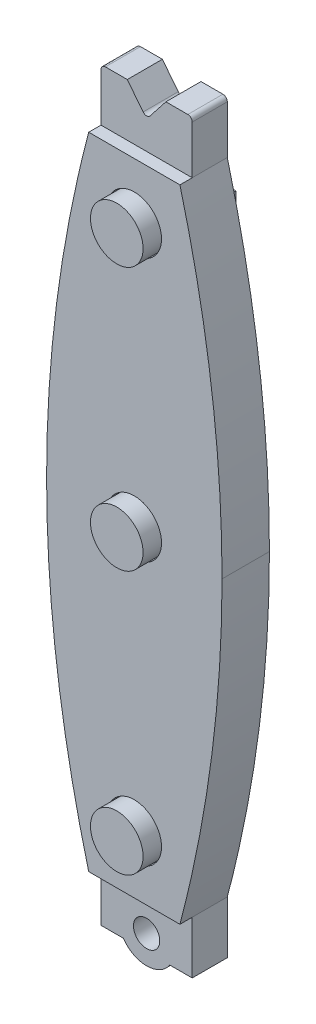
ISO-10303-21;
HEADER;
FILE_DESCRIPTION(('STEP AP214'),'2;1');
FILE_NAME('part.step','',(''),(''),'','','');
FILE_SCHEMA(('AUTOMOTIVE_DESIGN { 1 0 10303 214 1 1 1 1 }'));
ENDSEC;
DATA;
#1=APPLICATION_CONTEXT('core data for automotive mechanical design processes');
#2=APPLICATION_PROTOCOL_DEFINITION('international standard','automotive_design',2000,#1);
#3=PRODUCT_CONTEXT('',#1,'mechanical');
#4=PRODUCT('Part','Part','',(#3));
#5=PRODUCT_RELATED_PRODUCT_CATEGORY('part','',(#4));
#6=PRODUCT_DEFINITION_FORMATION('','',#4);
#7=PRODUCT_DEFINITION_CONTEXT('part definition',#1,'design');
#8=PRODUCT_DEFINITION('design','',#6,#7);
#9=PRODUCT_DEFINITION_SHAPE('','',#8);
#10=(LENGTH_UNIT() NAMED_UNIT(*) SI_UNIT(.MILLI.,.METRE.));
#11=(NAMED_UNIT(*) PLANE_ANGLE_UNIT() SI_UNIT($,.RADIAN.));
#12=(NAMED_UNIT(*) SI_UNIT($,.STERADIAN.) SOLID_ANGLE_UNIT());
#13=UNCERTAINTY_MEASURE_WITH_UNIT(LENGTH_MEASURE(1.E-05),#10,'distance_accuracy_value','');
#14=(GEOMETRIC_REPRESENTATION_CONTEXT(3) GLOBAL_UNCERTAINTY_ASSIGNED_CONTEXT((#13)) GLOBAL_UNIT_ASSIGNED_CONTEXT((#10,
#11,#12)) REPRESENTATION_CONTEXT('',''));
#15=CARTESIAN_POINT('',(0.,0.,0.));
#16=DIRECTION('',(0.,0.,1.));
#17=DIRECTION('',(1.,0.,0.));
#18=AXIS2_PLACEMENT_3D('',#15,#16,#17);
#19=CARTESIAN_POINT('',(0.,0.,0.));
#20=DIRECTION('',(0.,0.,1.));
#21=DIRECTION('',(1.,0.,0.));
#22=AXIS2_PLACEMENT_3D('',#19,#20,#21);
#23=PLANE('',#22);
#24=DIRECTION('',(0.,1.,0.));
#25=VECTOR('',#24,1.);
#26=CARTESIAN_POINT('',(-26.9659834710744,-62.6986404958678,0.));
#27=LINE('',#26,#25);
#28=CARTESIAN_POINT('',(-26.9659834710744,-58.3806404958678,0.));
#29=VERTEX_POINT('',#28);
#30=CARTESIAN_POINT('',(-26.9659834710744,-50.7606404958678,0.));
#31=VERTEX_POINT('',#30);
#32=EDGE_CURVE('E579',#29,#31,#27,.T.);
#33=ORIENTED_EDGE('',*,*,#32,.T.);
#34=CARTESIAN_POINT('',(-26.9659834710744,-50.7606404958678,0.));
#35=CARTESIAN_POINT('',(-33.0619834710744,-27.5831404958678,0.));
#36=CARTESIAN_POINT('',(-33.0619834710744,-4.40564049586777,0.));
#37=B_SPLINE_CURVE_WITH_KNOTS('',2,(#34,#35,#36),.UNSPECIFIED.,.F.,.F.,(3,3),(0.5,1.),.UNSPECIFIED.);
#38=CARTESIAN_POINT('',(-33.0619834710744,-4.40564049586777,0.));
#39=VERTEX_POINT('',#38);
#40=EDGE_CURVE('E219',#31,#39,#37,.T.);
#41=ORIENTED_EDGE('',*,*,#40,.T.);
#42=CARTESIAN_POINT('',(-33.0619834710744,-4.40564049586779,0.));
#43=CARTESIAN_POINT('',(-33.0619834710744,18.7718595041322,0.));
#44=CARTESIAN_POINT('',(-26.9659834710744,41.9493595041322,0.));
#45=B_SPLINE_CURVE_WITH_KNOTS('',2,(#42,#43,#44),.UNSPECIFIED.,.F.,.F.,(3,3),(0.,0.5),.UNSPECIFIED.);
#46=CARTESIAN_POINT('',(-26.9659834710744,41.9493595041322,0.));
#47=VERTEX_POINT('',#46);
#48=EDGE_CURVE('E291',#39,#47,#45,.T.);
#49=ORIENTED_EDGE('',*,*,#48,.T.);
#50=DIRECTION('',(0.,-1.,0.));
#51=VECTOR('',#50,1.);
#52=CARTESIAN_POINT('',(-26.9659834710744,49.5693595041322,0.));
#53=LINE('',#52,#51);
#54=CARTESIAN_POINT('',(-26.9659834710744,48.9343595041322,0.));
#55=VERTEX_POINT('',#54);
#56=EDGE_CURVE('E482',#55,#47,#53,.T.);
#57=ORIENTED_EDGE('',*,*,#56,.F.);
#58=CARTESIAN_POINT('',(-26.3309834710744,48.9343595041322,0.));
#59=DIRECTION('',(0.,0.,1.));
#60=DIRECTION('',(1.,0.,0.));
#61=AXIS2_PLACEMENT_3D('',#58,#59,#60);
#62=CIRCLE('',#61,0.635);
#63=CARTESIAN_POINT('',(-26.3309834710744,49.5693595041322,0.));
#64=VERTEX_POINT('',#63);
#65=EDGE_CURVE('E594',#55,#64,#62,.F.);
#66=ORIENTED_EDGE('',*,*,#65,.T.);
#67=DIRECTION('',(-1.,0.,0.));
#68=VECTOR('',#67,1.);
#69=CARTESIAN_POINT('',(-13.7579834710744,49.5693595041322,0.));
#70=LINE('',#69,#68);
#71=CARTESIAN_POINT('',(-23.1559834710744,49.5693595041322,0.));
#72=VERTEX_POINT('',#71);
#73=EDGE_CURVE('E478',#72,#64,#70,.T.);
#74=ORIENTED_EDGE('',*,*,#73,.F.);
#75=DIRECTION('',(0.617821551931903,-0.786318338822423,0.));
#76=VECTOR('',#75,1.);
#77=CARTESIAN_POINT('',(-23.1559834710744,49.5693595041322,0.));
#78=LINE('',#77,#76);
#79=CARTESIAN_POINT('',(-20.8612956162266,46.6488476888714,0.));
#80=VERTEX_POINT('',#79);
#81=EDGE_CURVE('E457',#72,#80,#78,.T.);
#82=ORIENTED_EDGE('',*,*,#81,.T.);
#83=CARTESIAN_POINT('',(-20.3619834710744,47.0411643743482,0.));
#84=DIRECTION('',(0.,0.,1.));
#85=DIRECTION('',(1.,0.,0.));
#86=AXIS2_PLACEMENT_3D('',#83,#84,#85);
#87=CIRCLE('',#86,0.635);
#88=CARTESIAN_POINT('',(-19.8626713259222,46.6488476888714,0.));
#89=VERTEX_POINT('',#88);
#90=EDGE_CURVE('E11',#80,#89,#87,.T.);
#91=ORIENTED_EDGE('',*,*,#90,.T.);
#92=DIRECTION('',(0.617821551931903,0.786318338822423,0.));
#93=VECTOR('',#92,1.);
#94=CARTESIAN_POINT('',(-20.3619834710744,46.0133595041322,0.));
#95=LINE('',#94,#93);
#96=CARTESIAN_POINT('',(-17.5679834710744,49.5693595041322,0.));
#97=VERTEX_POINT('',#96);
#98=EDGE_CURVE('E454',#89,#97,#95,.T.);
#99=ORIENTED_EDGE('',*,*,#98,.T.);
#100=CARTESIAN_POINT('',(-14.3929834710744,49.5693595041322,0.));
#101=VERTEX_POINT('',#100);
#102=EDGE_CURVE('E480',#101,#97,#70,.T.);
#103=ORIENTED_EDGE('',*,*,#102,.F.);
#104=CARTESIAN_POINT('',(-14.3929834710744,48.9343595041322,0.));
#105=DIRECTION('',(0.,0.,1.));
#106=DIRECTION('',(1.,0.,0.));
#107=AXIS2_PLACEMENT_3D('',#104,#105,#106);
#108=CIRCLE('',#107,0.635);
#109=CARTESIAN_POINT('',(-13.7579834710744,48.9343595041322,0.));
#110=VERTEX_POINT('',#109);
#111=EDGE_CURVE('E592',#101,#110,#108,.F.);
#112=ORIENTED_EDGE('',*,*,#111,.T.);
#113=DIRECTION('',(0.,-1.,0.));
#114=VECTOR('',#113,1.);
#115=CARTESIAN_POINT('',(-13.7579834710744,49.5693595041322,0.));
#116=LINE('',#115,#114);
#117=CARTESIAN_POINT('',(-13.7579834710744,41.9493595041322,0.));
#118=VERTEX_POINT('',#117);
#119=EDGE_CURVE('E493',#110,#118,#116,.T.);
#120=ORIENTED_EDGE('',*,*,#119,.T.);
#121=CARTESIAN_POINT('',(-13.7579834710744,41.9493595041322,0.));
#122=CARTESIAN_POINT('',(-7.6619834710744,18.7718595041322,0.));
#123=CARTESIAN_POINT('',(-7.6619834710744,-4.40564049586779,0.));
#124=B_SPLINE_CURVE_WITH_KNOTS('',2,(#121,#122,#123),.UNSPECIFIED.,.F.,.F.,(3,3),(0.,0.5),.UNSPECIFIED.);
#125=CARTESIAN_POINT('',(-7.6619834710744,-4.4056404958678,0.));
#126=VERTEX_POINT('',#125);
#127=EDGE_CURVE('E472',#118,#126,#124,.T.);
#128=ORIENTED_EDGE('',*,*,#127,.T.);
#129=CARTESIAN_POINT('',(-7.6619834710744,-4.4056404958678,0.));
#130=CARTESIAN_POINT('',(-7.66198347107439,-27.5831404958678,0.));
#131=CARTESIAN_POINT('',(-13.7579834710744,-50.7606404958678,0.));
#132=B_SPLINE_CURVE_WITH_KNOTS('',2,(#129,#130,#131),.UNSPECIFIED.,.F.,.F.,(3,3),(0.,
0.500000000000001),.UNSPECIFIED.);
#133=CARTESIAN_POINT('',(-13.7579834710744,-50.7606404958678,0.));
#134=VERTEX_POINT('',#133);
#135=EDGE_CURVE('E251',#126,#134,#132,.T.);
#136=ORIENTED_EDGE('',*,*,#135,.T.);
#137=DIRECTION('',(0.,1.,0.));
#138=VECTOR('',#137,1.);
#139=CARTESIAN_POINT('',(-13.7579834710744,-62.6986404958678,0.));
#140=LINE('',#139,#138);
#141=CARTESIAN_POINT('',(-13.7579834710744,-58.3806404958678,0.));
#142=VERTEX_POINT('',#141);
#143=EDGE_CURVE('E576',#142,#134,#140,.T.);
#144=ORIENTED_EDGE('',*,*,#143,.F.);
#145=DIRECTION('',(-1.,0.,0.));
#146=VECTOR('',#145,1.);
#147=CARTESIAN_POINT('',(-13.7579834710744,-58.3806404958678,0.));
#148=LINE('',#147,#146);
#149=CARTESIAN_POINT('',(-17.0018793060224,-58.3806404958678,0.));
#150=VERTEX_POINT('',#149);
#151=EDGE_CURVE('E557',#142,#150,#148,.T.);
#152=ORIENTED_EDGE('',*,*,#151,.T.);
#153=CARTESIAN_POINT('',(-20.3619834710744,-56.0946404958678,0.));
#154=DIRECTION('',(0.,0.,-1.));
#155=DIRECTION('',(1.,0.,0.));
#156=AXIS2_PLACEMENT_3D('',#153,#154,#155);
#157=CIRCLE('',#156,4.064);
#158=CARTESIAN_POINT('',(-23.7220876361264,-58.3806404958678,0.));
#159=VERTEX_POINT('',#158);
#160=EDGE_CURVE('E550',#150,#159,#157,.T.);
#161=ORIENTED_EDGE('',*,*,#160,.T.);
#162=DIRECTION('',(-1.,0.,0.));
#163=VECTOR('',#162,1.);
#164=CARTESIAN_POINT('',(-23.7220876361264,-58.3806404958678,0.));
#165=LINE('',#164,#163);
#166=EDGE_CURVE('E553',#159,#29,#165,.T.);
#167=ORIENTED_EDGE('',*,*,#166,.T.);
#168=EDGE_LOOP('',(#33,#41,#49,#57,#66,#74,#82,#91,#99,#103,#112,#120,#128,#136,#144,#152,#161,#167));
#169=FACE_BOUND('',#168,.T.);
#170=CARTESIAN_POINT('',(-20.3619834710744,-56.0946404958678,0.));
#171=DIRECTION('',(0.,0.,1.));
#172=DIRECTION('',(1.,0.,0.));
#173=AXIS2_PLACEMENT_3D('',#170,#171,#172);
#174=CIRCLE('',#173,1.905);
#175=CARTESIAN_POINT('',(-18.4569834710744,-56.0946404958678,0.));
#176=VERTEX_POINT('',#175);
#177=EDGE_CURVE('E544',#176,#176,#174,.T.);
#178=ORIENTED_EDGE('',*,*,#177,.T.);
#179=EDGE_LOOP('',(#178));
#180=FACE_BOUND('',#179,.T.);
#181=DIRECTION('',(0.,1.,0.));
#182=VECTOR('',#181,1.);
#183=CARTESIAN_POINT('',(-26.7119834710744,-45.6806404958678,0.));
#184=LINE('',#183,#182);
#185=CARTESIAN_POINT('',(-26.7119834710744,-45.6806404958678,0.));
#186=VERTEX_POINT('',#185);
#187=CARTESIAN_POINT('',(-26.7119834710744,36.8693595041322,0.));
#188=VERTEX_POINT('',#187);
#189=EDGE_CURVE('E216',#186,#188,#184,.T.);
#190=ORIENTED_EDGE('',*,*,#189,.F.);
#191=DIRECTION('',(-1.,0.,0.));
#192=VECTOR('',#191,1.);
#193=CARTESIAN_POINT('',(-14.0119834710744,-45.6806404958678,0.));
#194=LINE('',#193,#192);
#195=CARTESIAN_POINT('',(-14.0119834710744,-45.6806404958678,0.));
#196=VERTEX_POINT('',#195);
#197=EDGE_CURVE('E213',#196,#186,#194,.T.);
#198=ORIENTED_EDGE('',*,*,#197,.F.);
#199=DIRECTION('',(0.,-1.,0.));
#200=VECTOR('',#199,1.);
#201=CARTESIAN_POINT('',(-14.0119834710744,-45.6806404958678,0.));
#202=LINE('',#201,#200);
#203=CARTESIAN_POINT('',(-14.0119834710744,36.8693595041322,0.));
#204=VERTEX_POINT('',#203);
#205=EDGE_CURVE('E56',#204,#196,#202,.T.);
#206=ORIENTED_EDGE('',*,*,#205,.F.);
#207=DIRECTION('',(1.,0.,0.));
#208=VECTOR('',#207,1.);
#209=CARTESIAN_POINT('',(-14.0119834710744,36.8693595041322,0.));
#210=LINE('',#209,#208);
#211=EDGE_CURVE('E51',#188,#204,#210,.T.);
#212=ORIENTED_EDGE('',*,*,#211,.F.);
#213=EDGE_LOOP('',(#190,#198,#206,#212));
#214=FACE_BOUND('',#213,.T.);
#215=ADVANCED_FACE('F34',(#169,#180,#214),#23,.F.);
#216=CARTESIAN_POINT('',(0.,49.5693595041322,0.));
#217=DIRECTION('',(0.,1.,0.));
#218=DIRECTION('',(0.,0.,1.));
#219=AXIS2_PLACEMENT_3D('',#216,#217,#218);
#220=PLANE('',#219);
#221=DIRECTION('',(1.,0.,0.));
#222=VECTOR('',#221,1.);
#223=CARTESIAN_POINT('',(-13.7579834710744,49.5693595041322,5.08));
#224=LINE('',#223,#222);
#225=CARTESIAN_POINT('',(-17.5679834710744,49.5693595041322,5.08));
#226=VERTEX_POINT('',#225);
#227=CARTESIAN_POINT('',(-14.3929834710744,49.5693595041322,5.08));
#228=VERTEX_POINT('',#227);
#229=EDGE_CURVE('E479',#226,#228,#224,.T.);
#230=ORIENTED_EDGE('',*,*,#229,.T.);
#231=DIRECTION('',(0.,0.,-1.));
#232=VECTOR('',#231,1.);
#233=CARTESIAN_POINT('',(-14.3929834710744,49.5693595041322,0.));
#234=LINE('',#233,#232);
#235=EDGE_CURVE('E598',#228,#101,#234,.T.);
#236=ORIENTED_EDGE('',*,*,#235,.T.);
#237=ORIENTED_EDGE('',*,*,#102,.T.);
#238=DIRECTION('',(0.,0.,1.));
#239=VECTOR('',#238,1.);
#240=CARTESIAN_POINT('',(-17.5679834710744,49.5693595041322,0.));
#241=LINE('',#240,#239);
#242=EDGE_CURVE('E460',#97,#226,#241,.T.);
#243=ORIENTED_EDGE('',*,*,#242,.T.);
#244=EDGE_LOOP('',(#230,#236,#237,#243));
#245=FACE_BOUND('',#244,.T.);
#246=ADVANCED_FACE('F330',(#245),#220,.T.);
#247=CARTESIAN_POINT('',(-33.0619834710744,41.9493595041322,5.08));
#248=DIRECTION('',(0.,-1.,0.));
#249=DIRECTION('',(0.,0.,-1.));
#250=AXIS2_PLACEMENT_3D('',#247,#248,#249);
#251=PLANE('',#250);
#252=DIRECTION('',(1.,0.,0.));
#253=VECTOR('',#252,1.);
#254=CARTESIAN_POINT('',(-13.7579834710744,41.9493595041322,5.08));
#255=LINE('',#254,#253);
#256=CARTESIAN_POINT('',(-26.9659834710744,41.9493595041322,5.08));
#257=VERTEX_POINT('',#256);
#258=CARTESIAN_POINT('',(-13.7579834710744,41.9493595041322,5.08));
#259=VERTEX_POINT('',#258);
#260=EDGE_CURVE('E485',#257,#259,#255,.T.);
#261=ORIENTED_EDGE('',*,*,#260,.F.);
#262=DIRECTION('',(0.,0.,1.));
#263=VECTOR('',#262,1.);
#264=CARTESIAN_POINT('',(-26.9659834710744,41.9493595041322,-0.761999999999999));
#265=LINE('',#264,#263);
#266=CARTESIAN_POINT('',(-26.9659834710744,41.9493595041322,6.858));
#267=VERTEX_POINT('',#266);
#268=EDGE_CURVE('E284',#257,#267,#265,.T.);
#269=ORIENTED_EDGE('',*,*,#268,.T.);
#270=DIRECTION('',(-1.,0.,0.));
#271=VECTOR('',#270,1.);
#272=CARTESIAN_POINT('',(-7.6619834710744,41.9493595041322,6.858));
#273=LINE('',#272,#271);
#274=CARTESIAN_POINT('',(-13.7579834710744,41.9493595041322,6.858));
#275=VERTEX_POINT('',#274);
#276=EDGE_CURVE('E536',#275,#267,#273,.T.);
#277=ORIENTED_EDGE('',*,*,#276,.F.);
#278=DIRECTION('',(0.,0.,1.));
#279=VECTOR('',#278,1.);
#280=CARTESIAN_POINT('',(-13.7579834710744,41.9493595041322,-0.761999999999999));
#281=LINE('',#280,#279);
#282=EDGE_CURVE('E642',#259,#275,#281,.T.);
#283=ORIENTED_EDGE('',*,*,#282,.F.);
#284=EDGE_LOOP('',(#261,#269,#277,#283));
#285=FACE_BOUND('',#284,.T.);
#286=ADVANCED_FACE('F426',(#285),#251,.F.);
#287=CARTESIAN_POINT('',(-33.0619834710744,-50.7606404958678,5.08));
#288=DIRECTION('',(0.,1.,0.));
#289=DIRECTION('',(0.,0.,1.));
#290=AXIS2_PLACEMENT_3D('',#287,#288,#289);
#291=PLANE('',#290);
#292=DIRECTION('',(1.,0.,0.));
#293=VECTOR('',#292,1.);
#294=CARTESIAN_POINT('',(-7.6619834710744,-50.7606404958678,6.858));
#295=LINE('',#294,#293);
#296=CARTESIAN_POINT('',(-26.9659834710744,-50.7606404958678,6.858));
#297=VERTEX_POINT('',#296);
#298=CARTESIAN_POINT('',(-13.7579834710744,-50.7606404958678,6.858));
#299=VERTEX_POINT('',#298);
#300=EDGE_CURVE('E541',#297,#299,#295,.T.);
#301=ORIENTED_EDGE('',*,*,#300,.F.);
#302=DIRECTION('',(0.,0.,1.));
#303=VECTOR('',#302,1.);
#304=CARTESIAN_POINT('',(-26.9659834710744,-50.7606404958678,0.));
#305=LINE('',#304,#303);
#306=CARTESIAN_POINT('',(-26.9659834710744,-50.7606404958678,5.08));
#307=VERTEX_POINT('',#306);
#308=EDGE_CURVE('E229',#307,#297,#305,.T.);
#309=ORIENTED_EDGE('',*,*,#308,.F.);
#310=DIRECTION('',(1.,0.,0.));
#311=VECTOR('',#310,1.);
#312=CARTESIAN_POINT('',(-7.6619834710744,-50.7606404958678,5.08));
#313=LINE('',#312,#311);
#314=CARTESIAN_POINT('',(-13.7579834710744,-50.7606404958678,5.08));
#315=VERTEX_POINT('',#314);
#316=EDGE_CURVE('E582',#307,#315,#313,.T.);
#317=ORIENTED_EDGE('',*,*,#316,.T.);
#318=DIRECTION('',(0.,0.,1.));
#319=VECTOR('',#318,1.);
#320=CARTESIAN_POINT('',(-13.7579834710744,-50.7606404958678,0.));
#321=LINE('',#320,#319);
#322=EDGE_CURVE('E258',#315,#299,#321,.T.);
#323=ORIENTED_EDGE('',*,*,#322,.T.);
#324=EDGE_LOOP('',(#301,#309,#317,#323));
#325=FACE_BOUND('',#324,.T.);
#326=ADVANCED_FACE('F421',(#325),#291,.F.);
#327=CARTESIAN_POINT('',(0.,0.,5.08));
#328=DIRECTION('',(0.,0.,1.));
#329=DIRECTION('',(1.,0.,0.));
#330=AXIS2_PLACEMENT_3D('',#327,#328,#329);
#331=PLANE('',#330);
#332=ORIENTED_EDGE('',*,*,#316,.F.);
#333=DIRECTION('',(0.,1.,0.));
#334=VECTOR('',#333,1.);
#335=CARTESIAN_POINT('',(-26.9659834710744,-62.6986404958678,5.08));
#336=LINE('',#335,#334);
#337=CARTESIAN_POINT('',(-26.9659834710744,-58.3806404958678,5.08));
#338=VERTEX_POINT('',#337);
#339=EDGE_CURVE('E606',#338,#307,#336,.T.);
#340=ORIENTED_EDGE('',*,*,#339,.F.);
#341=DIRECTION('',(-1.,0.,0.));
#342=VECTOR('',#341,1.);
#343=CARTESIAN_POINT('',(-23.7220876361264,-58.3806404958678,5.08));
#344=LINE('',#343,#342);
#345=CARTESIAN_POINT('',(-23.7220876361264,-58.3806404958678,5.08));
#346=VERTEX_POINT('',#345);
#347=EDGE_CURVE('E563',#346,#338,#344,.T.);
#348=ORIENTED_EDGE('',*,*,#347,.F.);
#349=CARTESIAN_POINT('',(-20.3619834710744,-56.0946404958678,5.08));
#350=DIRECTION('',(0.,0.,-1.));
#351=DIRECTION('',(1.,0.,0.));
#352=AXIS2_PLACEMENT_3D('',#349,#350,#351);
#353=CIRCLE('',#352,4.064);
#354=CARTESIAN_POINT('',(-17.0018793060224,-58.3806404958678,5.08));
#355=VERTEX_POINT('',#354);
#356=EDGE_CURVE('E547',#355,#346,#353,.T.);
#357=ORIENTED_EDGE('',*,*,#356,.F.);
#358=DIRECTION('',(-1.,0.,0.));
#359=VECTOR('',#358,1.);
#360=CARTESIAN_POINT('',(-13.7579834710744,-58.3806404958678,5.08));
#361=LINE('',#360,#359);
#362=CARTESIAN_POINT('',(-13.7579834710744,-58.3806404958678,5.08));
#363=VERTEX_POINT('',#362);
#364=EDGE_CURVE('E554',#363,#355,#361,.T.);
#365=ORIENTED_EDGE('',*,*,#364,.F.);
#366=DIRECTION('',(0.,1.,0.));
#367=VECTOR('',#366,1.);
#368=CARTESIAN_POINT('',(-13.7579834710744,-62.6986404958678,5.08));
#369=LINE('',#368,#367);
#370=EDGE_CURVE('E580',#363,#315,#369,.T.);
#371=ORIENTED_EDGE('',*,*,#370,.T.);
#372=EDGE_LOOP('',(#332,#340,#348,#357,#365,#371));
#373=FACE_BOUND('',#372,.T.);
#374=CARTESIAN_POINT('',(-20.3619834710744,-56.0946404958678,5.08));
#375=DIRECTION('',(0.,0.,1.));
#376=DIRECTION('',(1.,0.,0.));
#377=AXIS2_PLACEMENT_3D('',#374,#375,#376);
#378=CIRCLE('',#377,1.905);
#379=CARTESIAN_POINT('',(-18.4569834710744,-56.0946404958678,5.08));
#380=VERTEX_POINT('',#379);
#381=EDGE_CURVE('E543',#380,#380,#378,.T.);
#382=ORIENTED_EDGE('',*,*,#381,.F.);
#383=EDGE_LOOP('',(#382));
#384=FACE_BOUND('',#383,.T.);
#385=ADVANCED_FACE('F417',(#373,#384),#331,.T.);
#386=CARTESIAN_POINT('',(-26.9659834710744,-62.6986404958678,5.08));
#387=DIRECTION('',(1.,0.,0.));
#388=DIRECTION('',(0.,0.,-1.));
#389=AXIS2_PLACEMENT_3D('',#386,#387,#388);
#390=PLANE('',#389);
#391=ORIENTED_EDGE('',*,*,#32,.F.);
#392=DIRECTION('',(0.,0.,1.));
#393=VECTOR('',#392,1.);
#394=CARTESIAN_POINT('',(-26.9659834710744,-58.3806404958678,0.));
#395=LINE('',#394,#393);
#396=EDGE_CURVE('E572',#29,#338,#395,.T.);
#397=ORIENTED_EDGE('',*,*,#396,.T.);
#398=ORIENTED_EDGE('',*,*,#339,.T.);
#399=DIRECTION('',(0.,0.,-1.));
#400=VECTOR('',#399,1.);
#401=CARTESIAN_POINT('',(-26.9659834710744,-50.7606404958678,5.08));
#402=LINE('',#401,#400);
#403=EDGE_CURVE('E569',#307,#31,#402,.T.);
#404=ORIENTED_EDGE('',*,*,#403,.T.);
#405=EDGE_LOOP('',(#391,#397,#398,#404));
#406=FACE_BOUND('',#405,.T.);
#407=ADVANCED_FACE('F413',(#406),#390,.F.);
#408=CARTESIAN_POINT('',(-13.7579834710744,-62.6986404958678,5.08));
#409=DIRECTION('',(-1.,0.,0.));
#410=DIRECTION('',(0.,0.,1.));
#411=AXIS2_PLACEMENT_3D('',#408,#409,#410);
#412=PLANE('',#411);
#413=ORIENTED_EDGE('',*,*,#370,.F.);
#414=DIRECTION('',(0.,0.,1.));
#415=VECTOR('',#414,1.);
#416=CARTESIAN_POINT('',(-13.7579834710744,-58.3806404958678,0.));
#417=LINE('',#416,#415);
#418=EDGE_CURVE('E570',#142,#363,#417,.T.);
#419=ORIENTED_EDGE('',*,*,#418,.F.);
#420=ORIENTED_EDGE('',*,*,#143,.T.);
#421=DIRECTION('',(0.,0.,1.));
#422=VECTOR('',#421,1.);
#423=CARTESIAN_POINT('',(-13.7579834710744,-50.7606404958678,5.08));
#424=LINE('',#423,#422);
#425=EDGE_CURVE('E609',#134,#315,#424,.T.);
#426=ORIENTED_EDGE('',*,*,#425,.T.);
#427=EDGE_LOOP('',(#413,#419,#420,#426));
#428=FACE_BOUND('',#427,.T.);
#429=ADVANCED_FACE('F409',(#428),#412,.F.);
#430=CARTESIAN_POINT('',(-20.3619834710744,-56.0946404958678,0.));
#431=DIRECTION('',(0.,0.,1.));
#432=DIRECTION('',(1.,0.,0.));
#433=AXIS2_PLACEMENT_3D('',#430,#431,#432);
#434=CYLINDRICAL_SURFACE('',#433,4.064);
#435=ORIENTED_EDGE('',*,*,#356,.T.);
#436=DIRECTION('',(0.,0.,1.));
#437=VECTOR('',#436,1.);
#438=CARTESIAN_POINT('',(-23.7220876361264,-58.3806404958678,0.));
#439=LINE('',#438,#437);
#440=EDGE_CURVE('E560',#159,#346,#439,.T.);
#441=ORIENTED_EDGE('',*,*,#440,.F.);
#442=ORIENTED_EDGE('',*,*,#160,.F.);
#443=DIRECTION('',(0.,0.,1.));
#444=VECTOR('',#443,1.);
#445=CARTESIAN_POINT('',(-17.0018793060224,-58.3806404958678,0.));
#446=LINE('',#445,#444);
#447=EDGE_CURVE('E567',#150,#355,#446,.T.);
#448=ORIENTED_EDGE('',*,*,#447,.T.);
#449=EDGE_LOOP('',(#435,#441,#442,#448));
#450=FACE_BOUND('',#449,.T.);
#451=ADVANCED_FACE('F402',(#450),#434,.T.);
#452=CARTESIAN_POINT('',(-13.7579834710744,-58.3806404958678,0.));
#453=DIRECTION('',(0.,1.,0.));
#454=DIRECTION('',(0.,0.,1.));
#455=AXIS2_PLACEMENT_3D('',#452,#453,#454);
#456=PLANE('',#455);
#457=ORIENTED_EDGE('',*,*,#364,.T.);
#458=ORIENTED_EDGE('',*,*,#447,.F.);
#459=ORIENTED_EDGE('',*,*,#151,.F.);
#460=ORIENTED_EDGE('',*,*,#418,.T.);
#461=EDGE_LOOP('',(#457,#458,#459,#460));
#462=FACE_BOUND('',#461,.T.);
#463=ADVANCED_FACE('F399',(#462),#456,.F.);
#464=CARTESIAN_POINT('',(-23.7220876361264,-58.3806404958678,0.));
#465=DIRECTION('',(0.,1.,0.));
#466=DIRECTION('',(0.,0.,1.));
#467=AXIS2_PLACEMENT_3D('',#464,#465,#466);
#468=PLANE('',#467);
#469=ORIENTED_EDGE('',*,*,#347,.T.);
#470=ORIENTED_EDGE('',*,*,#396,.F.);
#471=ORIENTED_EDGE('',*,*,#166,.F.);
#472=ORIENTED_EDGE('',*,*,#440,.T.);
#473=EDGE_LOOP('',(#469,#470,#471,#472));
#474=FACE_BOUND('',#473,.T.);
#475=ADVANCED_FACE('F397',(#474),#468,.F.);
#476=CARTESIAN_POINT('',(-20.3619834710744,-56.0946404958678,0.));
#477=DIRECTION('',(0.,0.,1.));
#478=DIRECTION('',(1.,0.,0.));
#479=AXIS2_PLACEMENT_3D('',#476,#477,#478);
#480=CYLINDRICAL_SURFACE('',#479,1.905);
#481=ORIENTED_EDGE('',*,*,#177,.F.);
#482=EDGE_LOOP('',(#481));
#483=FACE_BOUND('',#482,.T.);
#484=ORIENTED_EDGE('',*,*,#381,.T.);
#485=EDGE_LOOP('',(#484));
#486=FACE_BOUND('',#485,.T.);
#487=ADVANCED_FACE('F393',(#483,#486),#480,.F.);
#488=CARTESIAN_POINT('',(0.,0.,6.858));
#489=DIRECTION('',(0.,0.,1.));
#490=DIRECTION('',(1.,0.,0.));
#491=AXIS2_PLACEMENT_3D('',#488,#489,#490);
#492=PLANE('',#491);
#493=CARTESIAN_POINT('',(-26.9659834710744,-50.7606404958678,6.858));
#494=CARTESIAN_POINT('',(-33.0619834710744,-27.5831404958678,6.858));
#495=CARTESIAN_POINT('',(-33.0619834710744,-4.40564049586777,6.858));
#496=B_SPLINE_CURVE_WITH_KNOTS('',2,(#493,#494,#495),.UNSPECIFIED.,.F.,.F.,(3,3),(0.5,1.),.UNSPECIFIED.);
#497=CARTESIAN_POINT('',(-33.0619834710744,-4.40564049586777,6.858));
#498=VERTEX_POINT('',#497);
#499=EDGE_CURVE('E217',#297,#498,#496,.T.);
#500=ORIENTED_EDGE('',*,*,#499,.F.);
#501=ORIENTED_EDGE('',*,*,#300,.T.);
#502=CARTESIAN_POINT('',(-7.6619834710744,-4.4056404958678,6.858));
#503=CARTESIAN_POINT('',(-7.66198347107439,-27.5831404958678,6.858));
#504=CARTESIAN_POINT('',(-13.7579834710744,-50.7606404958678,6.858));
#505=B_SPLINE_CURVE_WITH_KNOTS('',2,(#502,#503,#504),.UNSPECIFIED.,.F.,.F.,(3,3),(0.,
0.500000000000001),.UNSPECIFIED.);
#506=CARTESIAN_POINT('',(-7.6619834710744,-4.4056404958678,6.858));
#507=VERTEX_POINT('',#506);
#508=EDGE_CURVE('E259',#507,#299,#505,.T.);
#509=ORIENTED_EDGE('',*,*,#508,.F.);
#510=CARTESIAN_POINT('',(-13.7579834710744,41.9493595041322,6.858));
#511=CARTESIAN_POINT('',(-7.6619834710744,18.7718595041322,6.858));
#512=CARTESIAN_POINT('',(-7.6619834710744,-4.40564049586779,6.858));
#513=B_SPLINE_CURVE_WITH_KNOTS('',2,(#510,#511,#512),.UNSPECIFIED.,.F.,.F.,(3,3),(0.,0.5),.UNSPECIFIED.);
#514=EDGE_CURVE('E298',#275,#507,#513,.T.);
#515=ORIENTED_EDGE('',*,*,#514,.F.);
#516=ORIENTED_EDGE('',*,*,#276,.T.);
#517=CARTESIAN_POINT('',(-33.0619834710744,-4.40564049586779,6.858));
#518=CARTESIAN_POINT('',(-33.0619834710744,18.7718595041322,6.858));
#519=CARTESIAN_POINT('',(-26.9659834710744,41.9493595041322,6.858));
#520=B_SPLINE_CURVE_WITH_KNOTS('',2,(#517,#518,#519),.UNSPECIFIED.,.F.,.F.,(3,3),(0.,0.5),.UNSPECIFIED.);
#521=EDGE_CURVE('E273',#498,#267,#520,.T.);
#522=ORIENTED_EDGE('',*,*,#521,.F.);
#523=EDGE_LOOP('',(#500,#501,#509,#515,#516,#522));
#524=FACE_BOUND('',#523,.T.);
#525=CARTESIAN_POINT('',(-20.3619834710744,-4.27864049586779,6.858));
#526=DIRECTION('',(0.,0.,1.));
#527=DIRECTION('',(1.,0.,0.));
#528=AXIS2_PLACEMENT_3D('',#525,#526,#527);
#529=CIRCLE('',#528,3.937);
#530=CARTESIAN_POINT('',(-16.4249834710744,-4.27864049586779,6.858));
#531=VERTEX_POINT('',#530);
#532=EDGE_CURVE('E525',#531,#531,#529,.T.);
#533=ORIENTED_EDGE('',*,*,#532,.F.);
#534=EDGE_LOOP('',(#533));
#535=FACE_BOUND('',#534,.T.);
#536=CARTESIAN_POINT('',(-20.3619834710744,33.8213595041322,6.858));
#537=DIRECTION('',(0.,0.,1.));
#538=DIRECTION('',(1.,0.,0.));
#539=AXIS2_PLACEMENT_3D('',#536,#537,#538);
#540=CIRCLE('',#539,3.937);
#541=CARTESIAN_POINT('',(-16.4249834710744,33.8213595041322,6.858));
#542=VERTEX_POINT('',#541);
#543=EDGE_CURVE('E518',#542,#542,#540,.T.);
#544=ORIENTED_EDGE('',*,*,#543,.F.);
#545=EDGE_LOOP('',(#544));
#546=FACE_BOUND('',#545,.T.);
#547=CARTESIAN_POINT('',(-20.3619834710744,-42.3786404958678,6.858));
#548=DIRECTION('',(0.,0.,1.));
#549=DIRECTION('',(1.,0.,0.));
#550=AXIS2_PLACEMENT_3D('',#547,#548,#549);
#551=CIRCLE('',#550,3.937);
#552=CARTESIAN_POINT('',(-16.4249834710744,-42.3786404958678,6.858));
#553=VERTEX_POINT('',#552);
#554=EDGE_CURVE('E524',#553,#553,#551,.T.);
#555=ORIENTED_EDGE('',*,*,#554,.F.);
#556=EDGE_LOOP('',(#555));
#557=FACE_BOUND('',#556,.T.);
#558=ADVANCED_FACE('F389',(#524,#535,#546,#557),#492,.T.);
#559=CARTESIAN_POINT('',(-20.3619834710744,-42.3786404958678,5.588));
#560=DIRECTION('',(0.,0.,1.));
#561=DIRECTION('',(1.,0.,0.));
#562=AXIS2_PLACEMENT_3D('',#559,#560,#561);
#563=CYLINDRICAL_SURFACE('',#562,3.937);
#564=CARTESIAN_POINT('',(-20.3619834710744,-42.3786404958678,5.588));
#565=DIRECTION('',(0.,0.,1.));
#566=DIRECTION('',(1.,0.,0.));
#567=AXIS2_PLACEMENT_3D('',#564,#565,#566);
#568=CIRCLE('',#567,3.937);
#569=CARTESIAN_POINT('',(-16.4249834710744,-42.3786404958678,5.588));
#570=VERTEX_POINT('',#569);
#571=EDGE_CURVE('E533',#570,#570,#568,.T.);
#572=ORIENTED_EDGE('',*,*,#571,.F.);
#573=EDGE_LOOP('',(#572));
#574=FACE_BOUND('',#573,.T.);
#575=ORIENTED_EDGE('',*,*,#554,.T.);
#576=EDGE_LOOP('',(#575));
#577=FACE_BOUND('',#576,.T.);
#578=ADVANCED_FACE('F385',(#574,#577),#563,.F.);
#579=CARTESIAN_POINT('',(-20.3619834710744,-42.3786404958678,5.588));
#580=DIRECTION('',(0.,0.,1.));
#581=DIRECTION('',(1.,0.,0.));
#582=AXIS2_PLACEMENT_3D('',#579,#580,#581);
#583=PLANE('',#582);
#584=CARTESIAN_POINT('',(-20.3619834710744,-42.3786404958678,5.588));
#585=DIRECTION('',(0.,0.,1.));
#586=DIRECTION('',(1.,0.,0.));
#587=AXIS2_PLACEMENT_3D('',#584,#585,#586);
#588=CIRCLE('',#587,3.81);
#589=CARTESIAN_POINT('',(-16.5519834710744,-42.3786404958678,5.588));
#590=VERTEX_POINT('',#589);
#591=EDGE_CURVE('E512',#590,#590,#588,.T.);
#592=ORIENTED_EDGE('',*,*,#591,.F.);
#593=EDGE_LOOP('',(#592));
#594=FACE_BOUND('',#593,.T.);
#595=ORIENTED_EDGE('',*,*,#571,.T.);
#596=EDGE_LOOP('',(#595));
#597=FACE_BOUND('',#596,.T.);
#598=ADVANCED_FACE('F381',(#594,#597),#583,.T.);
#599=CARTESIAN_POINT('',(-20.3619834710744,33.8213595041322,5.588));
#600=DIRECTION('',(0.,0.,1.));
#601=DIRECTION('',(1.,0.,0.));
#602=AXIS2_PLACEMENT_3D('',#599,#600,#601);
#603=CYLINDRICAL_SURFACE('',#602,3.937);
#604=CARTESIAN_POINT('',(-20.3619834710744,33.8213595041322,5.588));
#605=DIRECTION('',(0.,0.,1.));
#606=DIRECTION('',(1.,0.,0.));
#607=AXIS2_PLACEMENT_3D('',#604,#605,#606);
#608=CIRCLE('',#607,3.937);
#609=CARTESIAN_POINT('',(-16.4249834710744,33.8213595041322,5.588));
#610=VERTEX_POINT('',#609);
#611=EDGE_CURVE('E528',#610,#610,#608,.T.);
#612=ORIENTED_EDGE('',*,*,#611,.F.);
#613=EDGE_LOOP('',(#612));
#614=FACE_BOUND('',#613,.T.);
#615=ORIENTED_EDGE('',*,*,#543,.T.);
#616=EDGE_LOOP('',(#615));
#617=FACE_BOUND('',#616,.T.);
#618=ADVANCED_FACE('F377',(#614,#617),#603,.F.);
#619=CARTESIAN_POINT('',(-20.3619834710744,33.8213595041322,5.588));
#620=DIRECTION('',(0.,0.,1.));
#621=DIRECTION('',(1.,0.,0.));
#622=AXIS2_PLACEMENT_3D('',#619,#620,#621);
#623=PLANE('',#622);
#624=CARTESIAN_POINT('',(-20.3619834710744,33.8213595041322,5.588));
#625=DIRECTION('',(0.,0.,1.));
#626=DIRECTION('',(1.,0.,0.));
#627=AXIS2_PLACEMENT_3D('',#624,#625,#626);
#628=CIRCLE('',#627,3.81);
#629=CARTESIAN_POINT('',(-16.5519834710744,33.8213595041322,5.588));
#630=VERTEX_POINT('',#629);
#631=EDGE_CURVE('E502',#630,#630,#628,.T.);
#632=ORIENTED_EDGE('',*,*,#631,.F.);
#633=EDGE_LOOP('',(#632));
#634=FACE_BOUND('',#633,.T.);
#635=ORIENTED_EDGE('',*,*,#611,.T.);
#636=EDGE_LOOP('',(#635));
#637=FACE_BOUND('',#636,.T.);
#638=ADVANCED_FACE('F373',(#634,#637),#623,.T.);
#639=CARTESIAN_POINT('',(-20.3619834710744,-4.27864049586779,5.588));
#640=DIRECTION('',(0.,0.,1.));
#641=DIRECTION('',(1.,0.,0.));
#642=AXIS2_PLACEMENT_3D('',#639,#640,#641);
#643=CYLINDRICAL_SURFACE('',#642,3.937);
#644=CARTESIAN_POINT('',(-20.3619834710744,-4.27864049586779,5.588));
#645=DIRECTION('',(0.,0.,1.));
#646=DIRECTION('',(1.,0.,0.));
#647=AXIS2_PLACEMENT_3D('',#644,#645,#646);
#648=CIRCLE('',#647,3.937);
#649=CARTESIAN_POINT('',(-16.4249834710744,-4.27864049586779,5.588));
#650=VERTEX_POINT('',#649);
#651=EDGE_CURVE('E521',#650,#650,#648,.T.);
#652=ORIENTED_EDGE('',*,*,#651,.F.);
#653=EDGE_LOOP('',(#652));
#654=FACE_BOUND('',#653,.T.);
#655=ORIENTED_EDGE('',*,*,#532,.T.);
#656=EDGE_LOOP('',(#655));
#657=FACE_BOUND('',#656,.T.);
#658=ADVANCED_FACE('F369',(#654,#657),#643,.F.);
#659=CARTESIAN_POINT('',(-20.3619834710744,-4.27864049586779,5.588));
#660=DIRECTION('',(0.,0.,1.));
#661=DIRECTION('',(1.,0.,0.));
#662=AXIS2_PLACEMENT_3D('',#659,#660,#661);
#663=PLANE('',#662);
#664=CARTESIAN_POINT('',(-20.3619834710744,-4.27864049586779,5.588));
#665=DIRECTION('',(0.,0.,1.));
#666=DIRECTION('',(1.,0.,0.));
#667=AXIS2_PLACEMENT_3D('',#664,#665,#666);
#668=CIRCLE('',#667,3.81);
#669=CARTESIAN_POINT('',(-16.5519834710744,-4.27864049586779,5.588));
#670=VERTEX_POINT('',#669);
#671=EDGE_CURVE('E506',#670,#670,#668,.T.);
#672=ORIENTED_EDGE('',*,*,#671,.F.);
#673=EDGE_LOOP('',(#672));
#674=FACE_BOUND('',#673,.T.);
#675=ORIENTED_EDGE('',*,*,#651,.T.);
#676=EDGE_LOOP('',(#675));
#677=FACE_BOUND('',#676,.T.);
#678=ADVANCED_FACE('F365',(#674,#677),#663,.T.);
#679=CARTESIAN_POINT('',(-20.3619834710744,-42.3786404958678,9.398));
#680=DIRECTION('',(0.,0.,-1.));
#681=DIRECTION('',(-1.,0.,0.));
#682=AXIS2_PLACEMENT_3D('',#679,#680,#681);
#683=CYLINDRICAL_SURFACE('',#682,3.81);
#684=CARTESIAN_POINT('',(-20.3619834710744,-42.3786404958678,9.398));
#685=DIRECTION('',(0.,0.,1.));
#686=DIRECTION('',(1.,0.,0.));
#687=AXIS2_PLACEMENT_3D('',#684,#685,#686);
#688=CIRCLE('',#687,3.81);
#689=CARTESIAN_POINT('',(-16.5519834710744,-42.3786404958678,9.398));
#690=VERTEX_POINT('',#689);
#691=EDGE_CURVE('E515',#690,#690,#688,.T.);
#692=ORIENTED_EDGE('',*,*,#691,.F.);
#693=EDGE_LOOP('',(#692));
#694=FACE_BOUND('',#693,.T.);
#695=ORIENTED_EDGE('',*,*,#591,.T.);
#696=EDGE_LOOP('',(#695));
#697=FACE_BOUND('',#696,.T.);
#698=ADVANCED_FACE('F361',(#694,#697),#683,.T.);
#699=CARTESIAN_POINT('',(-20.3619834710744,-42.3786404958678,9.398));
#700=DIRECTION('',(0.,0.,1.));
#701=DIRECTION('',(1.,0.,0.));
#702=AXIS2_PLACEMENT_3D('',#699,#700,#701);
#703=PLANE('',#702);
#704=ORIENTED_EDGE('',*,*,#691,.T.);
#705=EDGE_LOOP('',(#704));
#706=FACE_BOUND('',#705,.T.);
#707=ADVANCED_FACE('F357',(#706),#703,.T.);
#708=CARTESIAN_POINT('',(-20.3619834710744,-4.27864049586779,9.398));
#709=DIRECTION('',(0.,0.,-1.));
#710=DIRECTION('',(-1.,0.,0.));
#711=AXIS2_PLACEMENT_3D('',#708,#709,#710);
#712=CYLINDRICAL_SURFACE('',#711,3.81);
#713=CARTESIAN_POINT('',(-20.3619834710744,-4.27864049586779,9.398));
#714=DIRECTION('',(0.,0.,1.));
#715=DIRECTION('',(1.,0.,0.));
#716=AXIS2_PLACEMENT_3D('',#713,#714,#715);
#717=CIRCLE('',#716,3.81);
#718=CARTESIAN_POINT('',(-16.5519834710744,-4.27864049586779,9.398));
#719=VERTEX_POINT('',#718);
#720=EDGE_CURVE('E509',#719,#719,#717,.T.);
#721=ORIENTED_EDGE('',*,*,#720,.F.);
#722=EDGE_LOOP('',(#721));
#723=FACE_BOUND('',#722,.T.);
#724=ORIENTED_EDGE('',*,*,#671,.T.);
#725=EDGE_LOOP('',(#724));
#726=FACE_BOUND('',#725,.T.);
#727=ADVANCED_FACE('F353',(#723,#726),#712,.T.);
#728=CARTESIAN_POINT('',(-20.3619834710744,-4.27864049586779,9.398));
#729=DIRECTION('',(0.,0.,1.));
#730=DIRECTION('',(1.,0.,0.));
#731=AXIS2_PLACEMENT_3D('',#728,#729,#730);
#732=PLANE('',#731);
#733=ORIENTED_EDGE('',*,*,#720,.T.);
#734=EDGE_LOOP('',(#733));
#735=FACE_BOUND('',#734,.T.);
#736=ADVANCED_FACE('F349',(#735),#732,.T.);
#737=CARTESIAN_POINT('',(-20.3619834710744,33.8213595041322,9.398));
#738=DIRECTION('',(0.,0.,-1.));
#739=DIRECTION('',(-1.,0.,0.));
#740=AXIS2_PLACEMENT_3D('',#737,#738,#739);
#741=CYLINDRICAL_SURFACE('',#740,3.81);
#742=CARTESIAN_POINT('',(-20.3619834710744,33.8213595041322,9.398));
#743=DIRECTION('',(0.,0.,1.));
#744=DIRECTION('',(1.,0.,0.));
#745=AXIS2_PLACEMENT_3D('',#742,#743,#744);
#746=CIRCLE('',#745,3.81);
#747=CARTESIAN_POINT('',(-16.5519834710744,33.8213595041322,9.398));
#748=VERTEX_POINT('',#747);
#749=EDGE_CURVE('E503',#748,#748,#746,.T.);
#750=ORIENTED_EDGE('',*,*,#749,.F.);
#751=EDGE_LOOP('',(#750));
#752=FACE_BOUND('',#751,.T.);
#753=ORIENTED_EDGE('',*,*,#631,.T.);
#754=EDGE_LOOP('',(#753));
#755=FACE_BOUND('',#754,.T.);
#756=ADVANCED_FACE('F345',(#752,#755),#741,.T.);
#757=CARTESIAN_POINT('',(-20.3619834710744,33.8213595041322,9.398));
#758=DIRECTION('',(0.,0.,1.));
#759=DIRECTION('',(1.,0.,0.));
#760=AXIS2_PLACEMENT_3D('',#757,#758,#759);
#761=PLANE('',#760);
#762=ORIENTED_EDGE('',*,*,#749,.T.);
#763=EDGE_LOOP('',(#762));
#764=FACE_BOUND('',#763,.T.);
#765=ADVANCED_FACE('F341',(#764),#761,.T.);
#766=CARTESIAN_POINT('',(-26.9659834710744,49.5693595041322,5.08));
#767=DIRECTION('',(1.,0.,0.));
#768=DIRECTION('',(0.,0.,-1.));
#769=AXIS2_PLACEMENT_3D('',#766,#767,#768);
#770=PLANE('',#769);
#771=DIRECTION('',(0.,-1.,0.));
#772=VECTOR('',#771,1.);
#773=CARTESIAN_POINT('',(-26.9659834710744,49.5693595041322,5.08));
#774=LINE('',#773,#772);
#775=CARTESIAN_POINT('',(-26.9659834710744,48.9343595041322,5.08));
#776=VERTEX_POINT('',#775);
#777=EDGE_CURVE('E499',#776,#257,#774,.T.);
#778=ORIENTED_EDGE('',*,*,#777,.F.);
#779=DIRECTION('',(0.,0.,1.));
#780=VECTOR('',#779,1.);
#781=CARTESIAN_POINT('',(-26.9659834710744,48.9343595041322,0.));
#782=LINE('',#781,#780);
#783=EDGE_CURVE('E590',#776,#55,#782,.F.);
#784=ORIENTED_EDGE('',*,*,#783,.T.);
#785=ORIENTED_EDGE('',*,*,#56,.T.);
#786=DIRECTION('',(0.,0.,1.));
#787=VECTOR('',#786,1.);
#788=CARTESIAN_POINT('',(-26.9659834710744,41.9493595041322,5.08));
#789=LINE('',#788,#787);
#790=EDGE_CURVE('E474',#47,#257,#789,.T.);
#791=ORIENTED_EDGE('',*,*,#790,.T.);
#792=EDGE_LOOP('',(#778,#784,#785,#791));
#793=FACE_BOUND('',#792,.T.);
#794=ADVANCED_FACE('F337',(#793),#770,.F.);
#795=CARTESIAN_POINT('',(-13.7579834710744,49.5693595041322,5.08));
#796=DIRECTION('',(0.,0.,-1.));
#797=DIRECTION('',(-1.,0.,0.));
#798=AXIS2_PLACEMENT_3D('',#795,#796,#797);
#799=PLANE('',#798);
#800=CARTESIAN_POINT('',(-26.3309834710744,49.5693595041322,5.08));
#801=VERTEX_POINT('',#800);
#802=CARTESIAN_POINT('',(-23.1559834710744,49.5693595041322,5.08));
#803=VERTEX_POINT('',#802);
#804=EDGE_CURVE('E476',#801,#803,#224,.T.);
#805=ORIENTED_EDGE('',*,*,#804,.F.);
#806=CARTESIAN_POINT('',(-26.3309834710744,48.9343595041322,5.08));
#807=DIRECTION('',(0.,0.,-1.));
#808=DIRECTION('',(-1.,0.,0.));
#809=AXIS2_PLACEMENT_3D('',#806,#807,#808);
#810=CIRCLE('',#809,0.635);
#811=EDGE_CURVE('E588',#801,#776,#810,.F.);
#812=ORIENTED_EDGE('',*,*,#811,.T.);
#813=ORIENTED_EDGE('',*,*,#777,.T.);
#814=ORIENTED_EDGE('',*,*,#260,.T.);
#815=DIRECTION('',(0.,-1.,0.));
#816=VECTOR('',#815,1.);
#817=CARTESIAN_POINT('',(-13.7579834710744,49.5693595041322,5.08));
#818=LINE('',#817,#816);
#819=CARTESIAN_POINT('',(-13.7579834710744,48.9343595041322,5.08));
#820=VERTEX_POINT('',#819);
#821=EDGE_CURVE('E496',#820,#259,#818,.T.);
#822=ORIENTED_EDGE('',*,*,#821,.F.);
#823=CARTESIAN_POINT('',(-14.3929834710744,48.9343595041322,5.08));
#824=DIRECTION('',(0.,0.,-1.));
#825=DIRECTION('',(-1.,0.,0.));
#826=AXIS2_PLACEMENT_3D('',#823,#824,#825);
#827=CIRCLE('',#826,0.635);
#828=EDGE_CURVE('E586',#820,#228,#827,.F.);
#829=ORIENTED_EDGE('',*,*,#828,.T.);
#830=ORIENTED_EDGE('',*,*,#229,.F.);
#831=DIRECTION('',(0.617821551931903,0.786318338822423,0.));
#832=VECTOR('',#831,1.);
#833=CARTESIAN_POINT('',(-20.3619834710744,46.0133595041322,5.08));
#834=LINE('',#833,#832);
#835=CARTESIAN_POINT('',(-19.8626713259222,46.6488476888714,5.08));
#836=VERTEX_POINT('',#835);
#837=EDGE_CURVE('E465',#836,#226,#834,.T.);
#838=ORIENTED_EDGE('',*,*,#837,.F.);
#839=CARTESIAN_POINT('',(-20.3619834710744,47.0411643743482,5.08));
#840=DIRECTION('',(0.,0.,-1.));
#841=DIRECTION('',(-1.,0.,0.));
#842=AXIS2_PLACEMENT_3D('',#839,#840,#841);
#843=CIRCLE('',#842,0.635);
#844=CARTESIAN_POINT('',(-20.8612956162266,46.6488476888714,5.08));
#845=VERTEX_POINT('',#844);
#846=EDGE_CURVE('E43',#836,#845,#843,.T.);
#847=ORIENTED_EDGE('',*,*,#846,.T.);
#848=DIRECTION('',(0.617821551931903,-0.786318338822423,0.));
#849=VECTOR('',#848,1.);
#850=CARTESIAN_POINT('',(-23.1559834710744,49.5693595041322,5.08));
#851=LINE('',#850,#849);
#852=EDGE_CURVE('E469',#803,#845,#851,.T.);
#853=ORIENTED_EDGE('',*,*,#852,.F.);
#854=EDGE_LOOP('',(#805,#812,#813,#814,#822,#829,#830,#838,#847,#853));
#855=FACE_BOUND('',#854,.T.);
#856=ADVANCED_FACE('F333',(#855),#799,.F.);
#857=CARTESIAN_POINT('',(-13.7579834710744,49.5693595041322,5.08));
#858=DIRECTION('',(-1.,0.,0.));
#859=DIRECTION('',(0.,0.,1.));
#860=AXIS2_PLACEMENT_3D('',#857,#858,#859);
#861=PLANE('',#860);
#862=ORIENTED_EDGE('',*,*,#119,.F.);
#863=DIRECTION('',(0.,0.,-1.));
#864=VECTOR('',#863,1.);
#865=CARTESIAN_POINT('',(-13.7579834710744,48.9343595041322,5.08));
#866=LINE('',#865,#864);
#867=EDGE_CURVE('E601',#110,#820,#866,.F.);
#868=ORIENTED_EDGE('',*,*,#867,.T.);
#869=ORIENTED_EDGE('',*,*,#821,.T.);
#870=DIRECTION('',(0.,0.,-1.));
#871=VECTOR('',#870,1.);
#872=CARTESIAN_POINT('',(-13.7579834710744,41.9493595041322,5.08));
#873=LINE('',#872,#871);
#874=EDGE_CURVE('E488',#259,#118,#873,.T.);
#875=ORIENTED_EDGE('',*,*,#874,.T.);
#876=EDGE_LOOP('',(#862,#868,#869,#875));
#877=FACE_BOUND('',#876,.T.);
#878=ADVANCED_FACE('F328',(#877),#861,.F.);
#879=ORIENTED_EDGE('',*,*,#73,.T.);
#880=DIRECTION('',(0.,0.,1.));
#881=VECTOR('',#880,1.);
#882=CARTESIAN_POINT('',(-26.3309834710744,49.5693595041322,5.08));
#883=LINE('',#882,#881);
#884=EDGE_CURVE('E583',#64,#801,#883,.T.);
#885=ORIENTED_EDGE('',*,*,#884,.T.);
#886=ORIENTED_EDGE('',*,*,#804,.T.);
#887=DIRECTION('',(0.,0.,1.));
#888=VECTOR('',#887,1.);
#889=CARTESIAN_POINT('',(-23.1559834710744,49.5693595041322,0.));
#890=LINE('',#889,#888);
#891=EDGE_CURVE('E461',#72,#803,#890,.T.);
#892=ORIENTED_EDGE('',*,*,#891,.F.);
#893=EDGE_LOOP('',(#879,#885,#886,#892));
#894=FACE_BOUND('',#893,.T.);
#895=ADVANCED_FACE('F320',(#894),#220,.T.);
#896=CARTESIAN_POINT('',(-20.3619834710744,46.0133595041322,0.));
#897=DIRECTION('',(0.786318338822423,-0.617821551931903,0.));
#898=DIRECTION('',(0.617821551931903,0.786318338822423,0.));
#899=AXIS2_PLACEMENT_3D('',#896,#897,#898);
#900=PLANE('',#899);
#901=ORIENTED_EDGE('',*,*,#98,.F.);
#902=DIRECTION('',(0.,0.,1.));
#903=VECTOR('',#902,1.);
#904=CARTESIAN_POINT('',(-19.8626713259222,46.6488476888714,5.08));
#905=LINE('',#904,#903);
#906=EDGE_CURVE('E447',#89,#836,#905,.T.);
#907=ORIENTED_EDGE('',*,*,#906,.T.);
#908=ORIENTED_EDGE('',*,*,#837,.T.);
#909=ORIENTED_EDGE('',*,*,#242,.F.);
#910=EDGE_LOOP('',(#901,#907,#908,#909));
#911=FACE_BOUND('',#910,.T.);
#912=ADVANCED_FACE('F316',(#911),#900,.F.);
#913=CARTESIAN_POINT('',(-23.1559834710744,49.5693595041322,0.));
#914=DIRECTION('',(-0.786318338822423,-0.617821551931903,0.));
#915=DIRECTION('',(0.617821551931903,-0.786318338822423,0.));
#916=AXIS2_PLACEMENT_3D('',#913,#914,#915);
#917=PLANE('',#916);
#918=ORIENTED_EDGE('',*,*,#852,.T.);
#919=DIRECTION('',(0.,0.,1.));
#920=VECTOR('',#919,1.);
#921=CARTESIAN_POINT('',(-20.8612956162266,46.6488476888714,0.));
#922=LINE('',#921,#920);
#923=EDGE_CURVE('E445',#845,#80,#922,.F.);
#924=ORIENTED_EDGE('',*,*,#923,.T.);
#925=ORIENTED_EDGE('',*,*,#81,.F.);
#926=ORIENTED_EDGE('',*,*,#891,.T.);
#927=EDGE_LOOP('',(#918,#924,#925,#926));
#928=FACE_BOUND('',#927,.T.);
#929=ADVANCED_FACE('F319',(#928),#917,.F.);
#930=CARTESIAN_POINT('',(-26.3309834710744,48.9343595041322,0.));
#931=DIRECTION('',(0.,0.,-1.));
#932=DIRECTION('',(-1.,0.,0.));
#933=AXIS2_PLACEMENT_3D('',#930,#931,#932);
#934=CYLINDRICAL_SURFACE('',#933,0.635);
#935=ORIENTED_EDGE('',*,*,#65,.F.);
#936=ORIENTED_EDGE('',*,*,#783,.F.);
#937=ORIENTED_EDGE('',*,*,#811,.F.);
#938=ORIENTED_EDGE('',*,*,#884,.F.);
#939=EDGE_LOOP('',(#935,#936,#937,#938));
#940=FACE_BOUND('',#939,.T.);
#941=ADVANCED_FACE('F324',(#940),#934,.T.);
#942=CARTESIAN_POINT('',(-20.3619834710744,47.0411643743482,0.));
#943=DIRECTION('',(0.,0.,-1.));
#944=DIRECTION('',(-1.,0.,0.));
#945=AXIS2_PLACEMENT_3D('',#942,#943,#944);
#946=CYLINDRICAL_SURFACE('',#945,0.635);
#947=ORIENTED_EDGE('',*,*,#90,.F.);
#948=ORIENTED_EDGE('',*,*,#923,.F.);
#949=ORIENTED_EDGE('',*,*,#846,.F.);
#950=ORIENTED_EDGE('',*,*,#906,.F.);
#951=EDGE_LOOP('',(#947,#948,#949,#950));
#952=FACE_BOUND('',#951,.T.);
#953=ADVANCED_FACE('F434',(#952),#946,.F.);
#954=CARTESIAN_POINT('',(-14.3929834710744,48.9343595041322,0.));
#955=DIRECTION('',(0.,0.,1.));
#956=DIRECTION('',(1.,0.,0.));
#957=AXIS2_PLACEMENT_3D('',#954,#955,#956);
#958=CYLINDRICAL_SURFACE('',#957,0.635);
#959=ORIENTED_EDGE('',*,*,#828,.F.);
#960=ORIENTED_EDGE('',*,*,#867,.F.);
#961=ORIENTED_EDGE('',*,*,#111,.F.);
#962=ORIENTED_EDGE('',*,*,#235,.F.);
#963=EDGE_LOOP('',(#959,#960,#961,#962));
#964=FACE_BOUND('',#963,.T.);
#965=ADVANCED_FACE('F36',(#964),#958,.T.);
#966=CARTESIAN_POINT('',(-13.7579834710744,41.9493595041322,-0.761999999999999));
#967=CARTESIAN_POINT('',(-7.6619834710744,18.7718595041322,-0.761999999999999));
#968=CARTESIAN_POINT('',(-7.6619834710744,-4.40564049586779,-0.761999999999999));
#969=B_SPLINE_CURVE_WITH_KNOTS('',2,(#966,#967,#968),.UNSPECIFIED.,.F.,.F.,(3,3),(0.,0.5),.UNSPECIFIED.);
#970=DIRECTION('',(0.,0.,1.));
#971=VECTOR('',#970,1.);
#972=SURFACE_OF_LINEAR_EXTRUSION('',#969,#971);
#973=ORIENTED_EDGE('',*,*,#874,.F.);
#974=ORIENTED_EDGE('',*,*,#282,.T.);
#975=ORIENTED_EDGE('',*,*,#514,.T.);
#976=DIRECTION('',(0.,0.,1.));
#977=VECTOR('',#976,1.);
#978=CARTESIAN_POINT('',(-7.6619834710744,-4.4056404958678,-0.761999999999999));
#979=LINE('',#978,#977);
#980=EDGE_CURVE('E655',#126,#507,#979,.T.);
#981=ORIENTED_EDGE('',*,*,#980,.F.);
#982=ORIENTED_EDGE('',*,*,#127,.F.);
#983=EDGE_LOOP('',(#973,#974,#975,#981,#982));
#984=FACE_BOUND('',#983,.T.);
#985=ADVANCED_FACE('F312',(#984),#972,.F.);
#986=CARTESIAN_POINT('',(-33.0619834710744,-4.40564049586779,-0.761999999999999));
#987=CARTESIAN_POINT('',(-33.0619834710744,18.7718595041322,-0.761999999999999));
#988=CARTESIAN_POINT('',(-26.9659834710744,41.9493595041322,-0.761999999999999));
#989=B_SPLINE_CURVE_WITH_KNOTS('',2,(#986,#987,#988),.UNSPECIFIED.,.F.,.F.,(3,3),(0.,0.5),.UNSPECIFIED.);
#990=DIRECTION('',(0.,0.,1.));
#991=VECTOR('',#990,1.);
#992=SURFACE_OF_LINEAR_EXTRUSION('',#989,#991);
#993=DIRECTION('',(0.,0.,1.));
#994=VECTOR('',#993,1.);
#995=CARTESIAN_POINT('',(-33.0619834710744,-4.40564049586777,-0.761999999999999));
#996=LINE('',#995,#994);
#997=EDGE_CURVE('E285',#39,#498,#996,.T.);
#998=ORIENTED_EDGE('',*,*,#997,.T.);
#999=ORIENTED_EDGE('',*,*,#521,.T.);
#1000=ORIENTED_EDGE('',*,*,#268,.F.);
#1001=ORIENTED_EDGE('',*,*,#790,.F.);
#1002=ORIENTED_EDGE('',*,*,#48,.F.);
#1003=EDGE_LOOP('',(#998,#999,#1000,#1001,#1002));
#1004=FACE_BOUND('',#1003,.T.);
#1005=ADVANCED_FACE('F247',(#1004),#992,.F.);
#1006=DIRECTION('',(0.,0.,1.));
#1007=VECTOR('',#1006,1.);
#1008=SURFACE_OF_LINEAR_EXTRUSION('',#132,#1007);
#1009=ORIENTED_EDGE('',*,*,#508,.T.);
#1010=ORIENTED_EDGE('',*,*,#322,.F.);
#1011=ORIENTED_EDGE('',*,*,#425,.F.);
#1012=ORIENTED_EDGE('',*,*,#135,.F.);
#1013=ORIENTED_EDGE('',*,*,#980,.T.);
#1014=EDGE_LOOP('',(#1009,#1010,#1011,#1012,#1013));
#1015=FACE_BOUND('',#1014,.T.);
#1016=ADVANCED_FACE('F241',(#1015),#1008,.F.);
#1017=DIRECTION('',(0.,0.,1.));
#1018=VECTOR('',#1017,1.);
#1019=SURFACE_OF_LINEAR_EXTRUSION('',#37,#1018);
#1020=ORIENTED_EDGE('',*,*,#499,.T.);
#1021=ORIENTED_EDGE('',*,*,#997,.F.);
#1022=ORIENTED_EDGE('',*,*,#40,.F.);
#1023=ORIENTED_EDGE('',*,*,#403,.F.);
#1024=ORIENTED_EDGE('',*,*,#308,.T.);
#1025=EDGE_LOOP('',(#1020,#1021,#1022,#1023,#1024));
#1026=FACE_BOUND('',#1025,.T.);
#1027=ADVANCED_FACE('F237',(#1026),#1019,.F.);
#1028=CARTESIAN_POINT('',(-26.7119834710744,-45.6806404958678,-1.524));
#1029=DIRECTION('',(1.,0.,0.));
#1030=DIRECTION('',(0.,0.,-1.));
#1031=AXIS2_PLACEMENT_3D('',#1028,#1029,#1030);
#1032=PLANE('',#1031);
#1033=ORIENTED_EDGE('',*,*,#189,.T.);
#1034=DIRECTION('',(0.,0.,1.));
#1035=VECTOR('',#1034,1.);
#1036=CARTESIAN_POINT('',(-26.7119834710744,36.8693595041322,-1.524));
#1037=LINE('',#1036,#1035);
#1038=CARTESIAN_POINT('',(-26.7119834710744,36.8693595041322,-1.524));
#1039=VERTEX_POINT('',#1038);
#1040=EDGE_CURVE('E197',#1039,#188,#1037,.T.);
#1041=ORIENTED_EDGE('',*,*,#1040,.F.);
#1042=DIRECTION('',(0.,1.,0.));
#1043=VECTOR('',#1042,1.);
#1044=CARTESIAN_POINT('',(-26.7119834710744,-45.6806404958678,-1.524));
#1045=LINE('',#1044,#1043);
#1046=CARTESIAN_POINT('',(-26.7119834710744,-45.6806404958678,-1.524));
#1047=VERTEX_POINT('',#1046);
#1048=EDGE_CURVE('E204',#1047,#1039,#1045,.T.);
#1049=ORIENTED_EDGE('',*,*,#1048,.F.);
#1050=DIRECTION('',(0.,0.,1.));
#1051=VECTOR('',#1050,1.);
#1052=CARTESIAN_POINT('',(-26.7119834710744,-45.6806404958678,-1.524));
#1053=LINE('',#1052,#1051);
#1054=EDGE_CURVE('E1039',#1047,#186,#1053,.T.);
#1055=ORIENTED_EDGE('',*,*,#1054,.T.);
#1056=EDGE_LOOP('',(#1033,#1041,#1049,#1055));
#1057=FACE_BOUND('',#1056,.T.);
#1058=ADVANCED_FACE('F215',(#1057),#1032,.F.);
#1059=CARTESIAN_POINT('',(-14.0119834710744,36.8693595041322,-1.524));
#1060=DIRECTION('',(0.,-1.,0.));
#1061=DIRECTION('',(0.,0.,-1.));
#1062=AXIS2_PLACEMENT_3D('',#1059,#1060,#1061);
#1063=PLANE('',#1062);
#1064=ORIENTED_EDGE('',*,*,#211,.T.);
#1065=DIRECTION('',(0.,0.,1.));
#1066=VECTOR('',#1065,1.);
#1067=CARTESIAN_POINT('',(-14.0119834710744,36.8693595041322,-1.524));
#1068=LINE('',#1067,#1066);
#1069=CARTESIAN_POINT('',(-14.0119834710744,36.8693595041322,-1.524));
#1070=VERTEX_POINT('',#1069);
#1071=EDGE_CURVE('E200',#1070,#204,#1068,.T.);
#1072=ORIENTED_EDGE('',*,*,#1071,.F.);
#1073=DIRECTION('',(1.,0.,0.));
#1074=VECTOR('',#1073,1.);
#1075=CARTESIAN_POINT('',(-14.0119834710744,36.8693595041322,-1.524));
#1076=LINE('',#1075,#1074);
#1077=EDGE_CURVE('E193',#1039,#1070,#1076,.T.);
#1078=ORIENTED_EDGE('',*,*,#1077,.F.);
#1079=ORIENTED_EDGE('',*,*,#1040,.T.);
#1080=EDGE_LOOP('',(#1064,#1072,#1078,#1079));
#1081=FACE_BOUND('',#1080,.T.);
#1082=ADVANCED_FACE('F195',(#1081),#1063,.F.);
#1083=CARTESIAN_POINT('',(-14.0119834710744,-45.6806404958678,-1.524));
#1084=DIRECTION('',(-1.,0.,0.));
#1085=DIRECTION('',(0.,0.,1.));
#1086=AXIS2_PLACEMENT_3D('',#1083,#1084,#1085);
#1087=PLANE('',#1086);
#1088=ORIENTED_EDGE('',*,*,#205,.T.);
#1089=DIRECTION('',(0.,0.,1.));
#1090=VECTOR('',#1089,1.);
#1091=CARTESIAN_POINT('',(-14.0119834710744,-45.6806404958678,-1.524));
#1092=LINE('',#1091,#1090);
#1093=CARTESIAN_POINT('',(-14.0119834710744,-45.6806404958678,-1.524));
#1094=VERTEX_POINT('',#1093);
#1095=EDGE_CURVE('E221',#1094,#196,#1092,.T.);
#1096=ORIENTED_EDGE('',*,*,#1095,.F.);
#1097=DIRECTION('',(0.,-1.,0.));
#1098=VECTOR('',#1097,1.);
#1099=CARTESIAN_POINT('',(-14.0119834710744,-45.6806404958678,-1.524));
#1100=LINE('',#1099,#1098);
#1101=EDGE_CURVE('E203',#1070,#1094,#1100,.T.);
#1102=ORIENTED_EDGE('',*,*,#1101,.F.);
#1103=ORIENTED_EDGE('',*,*,#1071,.T.);
#1104=EDGE_LOOP('',(#1088,#1096,#1102,#1103));
#1105=FACE_BOUND('',#1104,.T.);
#1106=ADVANCED_FACE('F835',(#1105),#1087,.F.);
#1107=CARTESIAN_POINT('',(-14.0119834710744,-45.6806404958678,-1.524));
#1108=DIRECTION('',(0.,1.,0.));
#1109=DIRECTION('',(0.,0.,1.));
#1110=AXIS2_PLACEMENT_3D('',#1107,#1108,#1109);
#1111=PLANE('',#1110);
#1112=ORIENTED_EDGE('',*,*,#197,.T.);
#1113=ORIENTED_EDGE('',*,*,#1054,.F.);
#1114=DIRECTION('',(-1.,0.,0.));
#1115=VECTOR('',#1114,1.);
#1116=CARTESIAN_POINT('',(-14.0119834710744,-45.6806404958678,-1.524));
#1117=LINE('',#1116,#1115);
#1118=EDGE_CURVE('E209',#1094,#1047,#1117,.T.);
#1119=ORIENTED_EDGE('',*,*,#1118,.F.);
#1120=ORIENTED_EDGE('',*,*,#1095,.T.);
#1121=EDGE_LOOP('',(#1112,#1113,#1119,#1120));
#1122=FACE_BOUND('',#1121,.T.);
#1123=ADVANCED_FACE('F841',(#1122),#1111,.F.);
#1124=CARTESIAN_POINT('',(0.,0.,-1.524));
#1125=DIRECTION('',(0.,0.,1.));
#1126=DIRECTION('',(1.,0.,0.));
#1127=AXIS2_PLACEMENT_3D('',#1124,#1125,#1126);
#1128=PLANE('',#1127);
#1129=ORIENTED_EDGE('',*,*,#1048,.T.);
#1130=ORIENTED_EDGE('',*,*,#1077,.T.);
#1131=ORIENTED_EDGE('',*,*,#1101,.T.);
#1132=ORIENTED_EDGE('',*,*,#1118,.T.);
#1133=EDGE_LOOP('',(#1129,#1130,#1131,#1132));
#1134=FACE_BOUND('',#1133,.T.);
#1135=ADVANCED_FACE('F207',(#1134),#1128,.F.);
#1136=CLOSED_SHELL('',(#215,#246,#286,#326,#385,#407,#429,#451,#463,#475,#487,#558,#578,#598,
#618,#638,#658,#678,#698,#707,#727,#736,#756,#765,#794,#856,#878,#895,#912,#929,#941,#953,#965,
#985,#1005,#1016,#1027,#1058,#1082,#1106,#1123,#1135));
#1137=MANIFOLD_SOLID_BREP('B2',#1136);
#1138=ADVANCED_BREP_SHAPE_REPRESENTATION('',(#18,#1137),#14);
#1139=SHAPE_DEFINITION_REPRESENTATION(#9,#1138);
ENDSEC;
END-ISO-10303-21;
